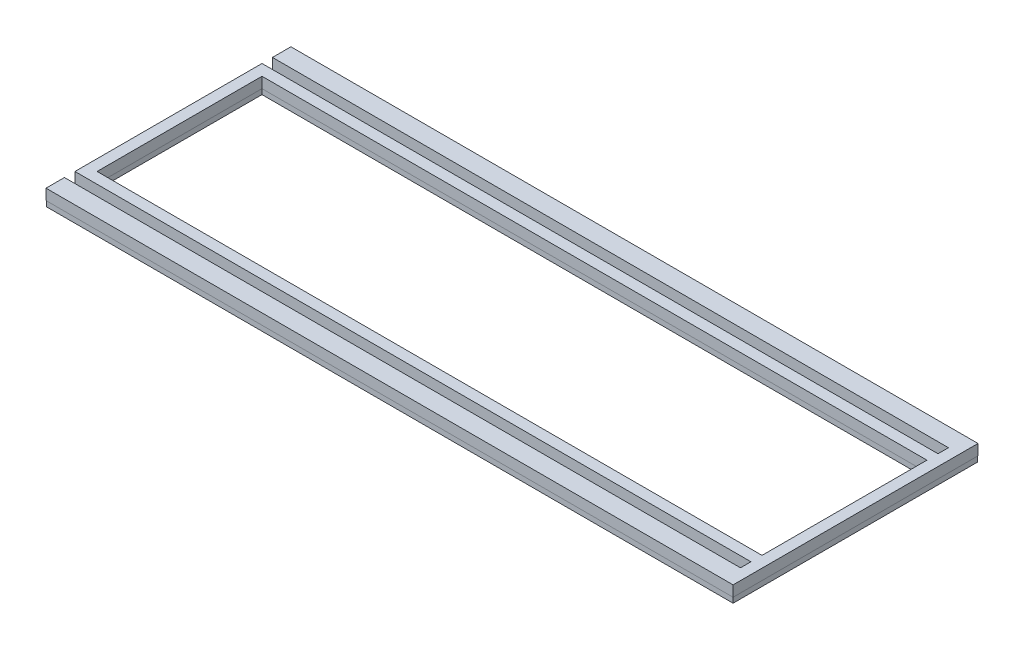
ISO-10303-21;
HEADER;
FILE_DESCRIPTION(('STEP AP214'),'2;1');
FILE_NAME('part.step','',(''),(''),'','','');
FILE_SCHEMA(('AUTOMOTIVE_DESIGN { 1 0 10303 214 1 1 1 1 }'));
ENDSEC;
DATA;
#1=APPLICATION_CONTEXT('core data for automotive mechanical design processes');
#2=APPLICATION_PROTOCOL_DEFINITION('international standard','automotive_design',2000,#1);
#3=PRODUCT_CONTEXT('',#1,'mechanical');
#4=PRODUCT('Part','Part','',(#3));
#5=PRODUCT_RELATED_PRODUCT_CATEGORY('part','',(#4));
#6=PRODUCT_DEFINITION_FORMATION('','',#4);
#7=PRODUCT_DEFINITION_CONTEXT('part definition',#1,'design');
#8=PRODUCT_DEFINITION('design','',#6,#7);
#9=PRODUCT_DEFINITION_SHAPE('','',#8);
#10=(LENGTH_UNIT() NAMED_UNIT(*) SI_UNIT(.MILLI.,.METRE.));
#11=(NAMED_UNIT(*) PLANE_ANGLE_UNIT() SI_UNIT($,.RADIAN.));
#12=(NAMED_UNIT(*) SI_UNIT($,.STERADIAN.) SOLID_ANGLE_UNIT());
#13=UNCERTAINTY_MEASURE_WITH_UNIT(LENGTH_MEASURE(1.E-05),#10,'distance_accuracy_value','');
#14=(GEOMETRIC_REPRESENTATION_CONTEXT(3) GLOBAL_UNCERTAINTY_ASSIGNED_CONTEXT((#13)) GLOBAL_UNIT_ASSIGNED_CONTEXT((#10,
#11,#12)) REPRESENTATION_CONTEXT('',''));
#15=CARTESIAN_POINT('',(0.,0.,0.));
#16=DIRECTION('',(0.,0.,1.));
#17=DIRECTION('',(1.,0.,0.));
#18=AXIS2_PLACEMENT_3D('',#15,#16,#17);
#19=CARTESIAN_POINT('',(0.,1.5875,-61.648975));
#20=DIRECTION('',(0.,0.,-1.));
#21=DIRECTION('',(-1.,0.,0.));
#22=AXIS2_PLACEMENT_3D('',#19,#20,#21);
#23=PLANE('',#22);
#24=DIRECTION('',(1.,0.,0.));
#25=VECTOR('',#24,1.);
#26=CARTESIAN_POINT('',(0.,-1.5875,-61.648975));
#27=LINE('',#26,#25);
#28=CARTESIAN_POINT('',(-203.2,-1.5875,-61.648975));
#29=VERTEX_POINT('',#28);
#30=CARTESIAN_POINT('',(196.85,-1.5875,-61.648975));
#31=VERTEX_POINT('',#30);
#32=EDGE_CURVE('E220',#29,#31,#27,.T.);
#33=ORIENTED_EDGE('',*,*,#32,.T.);
#34=DIRECTION('',(0.,-1.,0.));
#35=VECTOR('',#34,1.);
#36=CARTESIAN_POINT('',(196.85,1.5875,-61.648975));
#37=LINE('',#36,#35);
#38=CARTESIAN_POINT('',(196.85,1.5875,-61.648975));
#39=VERTEX_POINT('',#38);
#40=EDGE_CURVE('E12',#39,#31,#37,.T.);
#41=ORIENTED_EDGE('',*,*,#40,.F.);
#42=DIRECTION('',(1.,0.,0.));
#43=VECTOR('',#42,1.);
#44=CARTESIAN_POINT('',(0.,1.5875,-61.648975));
#45=LINE('',#44,#43);
#46=CARTESIAN_POINT('',(-203.2,1.5875,-61.648975));
#47=VERTEX_POINT('',#46);
#48=EDGE_CURVE('E321',#47,#39,#45,.T.);
#49=ORIENTED_EDGE('',*,*,#48,.F.);
#50=DIRECTION('',(0.,-1.,0.));
#51=VECTOR('',#50,1.);
#52=CARTESIAN_POINT('',(-203.2,1.5875,-61.648975));
#53=LINE('',#52,#51);
#54=EDGE_CURVE('E263',#47,#29,#53,.T.);
#55=ORIENTED_EDGE('',*,*,#54,.T.);
#56=EDGE_LOOP('',(#33,#41,#49,#55));
#57=FACE_BOUND('',#56,.T.);
#58=ADVANCED_FACE('F44',(#57),#23,.F.);
#59=CARTESIAN_POINT('',(196.85,1.5875,0.));
#60=DIRECTION('',(1.,0.,0.));
#61=DIRECTION('',(0.,0.,-1.));
#62=AXIS2_PLACEMENT_3D('',#59,#60,#61);
#63=PLANE('',#62);
#64=DIRECTION('',(0.,0.,1.));
#65=VECTOR('',#64,1.);
#66=CARTESIAN_POINT('',(196.85,-1.5875,0.));
#67=LINE('',#66,#65);
#68=CARTESIAN_POINT('',(196.85,-1.5875,-55.248175));
#69=VERTEX_POINT('',#68);
#70=EDGE_CURVE('E224',#31,#69,#67,.T.);
#71=ORIENTED_EDGE('',*,*,#70,.T.);
#72=DIRECTION('',(0.,-1.,0.));
#73=VECTOR('',#72,1.);
#74=CARTESIAN_POINT('',(196.85,1.5875,-55.248175));
#75=LINE('',#74,#73);
#76=CARTESIAN_POINT('',(196.85,1.5875,-55.248175));
#77=VERTEX_POINT('',#76);
#78=EDGE_CURVE('E55',#77,#69,#75,.T.);
#79=ORIENTED_EDGE('',*,*,#78,.F.);
#80=DIRECTION('',(0.,0.,1.));
#81=VECTOR('',#80,1.);
#82=CARTESIAN_POINT('',(196.85,1.5875,0.));
#83=LINE('',#82,#81);
#84=EDGE_CURVE('E335',#39,#77,#83,.T.);
#85=ORIENTED_EDGE('',*,*,#84,.F.);
#86=ORIENTED_EDGE('',*,*,#40,.T.);
#87=EDGE_LOOP('',(#71,#79,#85,#86));
#88=FACE_BOUND('',#87,.T.);
#89=ADVANCED_FACE('F378',(#88),#63,.F.);
#90=CARTESIAN_POINT('',(0.,1.5875,-55.248175));
#91=DIRECTION('',(0.,0.,-1.));
#92=DIRECTION('',(-1.,0.,0.));
#93=AXIS2_PLACEMENT_3D('',#90,#91,#92);
#94=PLANE('',#93);
#95=DIRECTION('',(1.,0.,0.));
#96=VECTOR('',#95,1.);
#97=CARTESIAN_POINT('',(0.,-1.5875,-55.248175));
#98=LINE('',#97,#96);
#99=CARTESIAN_POINT('',(-203.2,-1.5875,-55.248175));
#100=VERTEX_POINT('',#99);
#101=EDGE_CURVE('E228',#100,#69,#98,.T.);
#102=ORIENTED_EDGE('',*,*,#101,.F.);
#103=DIRECTION('',(0.,-1.,0.));
#104=VECTOR('',#103,1.);
#105=CARTESIAN_POINT('',(-203.2,1.5875,-55.248175));
#106=LINE('',#105,#104);
#107=CARTESIAN_POINT('',(-203.2,1.5875,-55.248175));
#108=VERTEX_POINT('',#107);
#109=EDGE_CURVE('E285',#108,#100,#106,.T.);
#110=ORIENTED_EDGE('',*,*,#109,.F.);
#111=DIRECTION('',(1.,0.,0.));
#112=VECTOR('',#111,1.);
#113=CARTESIAN_POINT('',(0.,1.5875,-55.248175));
#114=LINE('',#113,#112);
#115=EDGE_CURVE('E339',#108,#77,#114,.T.);
#116=ORIENTED_EDGE('',*,*,#115,.T.);
#117=ORIENTED_EDGE('',*,*,#78,.T.);
#118=EDGE_LOOP('',(#102,#110,#116,#117));
#119=FACE_BOUND('',#118,.T.);
#120=ADVANCED_FACE('F384',(#119),#94,.T.);
#121=CARTESIAN_POINT('',(-203.2,1.5875,0.));
#122=DIRECTION('',(1.,0.,0.));
#123=DIRECTION('',(0.,0.,-1.));
#124=AXIS2_PLACEMENT_3D('',#121,#122,#123);
#125=PLANE('',#124);
#126=DIRECTION('',(0.,0.,1.));
#127=VECTOR('',#126,1.);
#128=CARTESIAN_POINT('',(-203.2,-1.5875,0.));
#129=LINE('',#128,#127);
#130=CARTESIAN_POINT('',(-203.2,-1.5875,55.248175));
#131=VERTEX_POINT('',#130);
#132=EDGE_CURVE('E232',#100,#131,#129,.T.);
#133=ORIENTED_EDGE('',*,*,#132,.T.);
#134=DIRECTION('',(0.,-1.,0.));
#135=VECTOR('',#134,1.);
#136=CARTESIAN_POINT('',(-203.2,1.5875,55.248175));
#137=LINE('',#136,#135);
#138=CARTESIAN_POINT('',(-203.2,1.5875,55.248175));
#139=VERTEX_POINT('',#138);
#140=EDGE_CURVE('E281',#139,#131,#137,.T.);
#141=ORIENTED_EDGE('',*,*,#140,.F.);
#142=DIRECTION('',(0.,0.,1.));
#143=VECTOR('',#142,1.);
#144=CARTESIAN_POINT('',(-203.2,1.5875,0.));
#145=LINE('',#144,#143);
#146=EDGE_CURVE('E343',#108,#139,#145,.T.);
#147=ORIENTED_EDGE('',*,*,#146,.F.);
#148=ORIENTED_EDGE('',*,*,#109,.T.);
#149=EDGE_LOOP('',(#133,#141,#147,#148));
#150=FACE_BOUND('',#149,.T.);
#151=ADVANCED_FACE('F1012',(#150),#125,.F.);
#152=CARTESIAN_POINT('',(0.,1.5875,55.248175));
#153=DIRECTION('',(0.,0.,-1.));
#154=DIRECTION('',(-1.,0.,0.));
#155=AXIS2_PLACEMENT_3D('',#152,#153,#154);
#156=PLANE('',#155);
#157=DIRECTION('',(1.,0.,0.));
#158=VECTOR('',#157,1.);
#159=CARTESIAN_POINT('',(0.,-1.5875,55.248175));
#160=LINE('',#159,#158);
#161=CARTESIAN_POINT('',(196.85,-1.5875,55.248175));
#162=VERTEX_POINT('',#161);
#163=EDGE_CURVE('E235',#131,#162,#160,.T.);
#164=ORIENTED_EDGE('',*,*,#163,.T.);
#165=DIRECTION('',(0.,-1.,0.));
#166=VECTOR('',#165,1.);
#167=CARTESIAN_POINT('',(196.85,1.5875,55.248175));
#168=LINE('',#167,#166);
#169=CARTESIAN_POINT('',(196.85,1.5875,55.248175));
#170=VERTEX_POINT('',#169);
#171=EDGE_CURVE('E278',#170,#162,#168,.T.);
#172=ORIENTED_EDGE('',*,*,#171,.F.);
#173=DIRECTION('',(1.,0.,0.));
#174=VECTOR('',#173,1.);
#175=CARTESIAN_POINT('',(0.,1.5875,55.248175));
#176=LINE('',#175,#174);
#177=EDGE_CURVE('E347',#139,#170,#176,.T.);
#178=ORIENTED_EDGE('',*,*,#177,.F.);
#179=ORIENTED_EDGE('',*,*,#140,.T.);
#180=EDGE_LOOP('',(#164,#172,#178,#179));
#181=FACE_BOUND('',#180,.T.);
#182=ADVANCED_FACE('F1003',(#181),#156,.F.);
#183=CARTESIAN_POINT('',(196.85,1.5875,8.53594091353668E-13));
#184=DIRECTION('',(-1.,0.,0.));
#185=DIRECTION('',(0.,0.,1.));
#186=AXIS2_PLACEMENT_3D('',#183,#184,#185);
#187=PLANE('',#186);
#188=DIRECTION('',(0.,0.,-1.));
#189=VECTOR('',#188,1.);
#190=CARTESIAN_POINT('',(196.85,-1.5875,8.53594091353668E-13));
#191=LINE('',#190,#189);
#192=CARTESIAN_POINT('',(196.85,-1.5875,61.648975));
#193=VERTEX_POINT('',#192);
#194=EDGE_CURVE('E239',#193,#162,#191,.T.);
#195=ORIENTED_EDGE('',*,*,#194,.F.);
#196=DIRECTION('',(0.,-1.,0.));
#197=VECTOR('',#196,1.);
#198=CARTESIAN_POINT('',(196.85,1.5875,61.648975));
#199=LINE('',#198,#197);
#200=CARTESIAN_POINT('',(196.85,1.5875,61.648975));
#201=VERTEX_POINT('',#200);
#202=EDGE_CURVE('E275',#201,#193,#199,.T.);
#203=ORIENTED_EDGE('',*,*,#202,.F.);
#204=DIRECTION('',(0.,0.,-1.));
#205=VECTOR('',#204,1.);
#206=CARTESIAN_POINT('',(196.85,1.5875,8.53594091353668E-13));
#207=LINE('',#206,#205);
#208=EDGE_CURVE('E351',#201,#170,#207,.T.);
#209=ORIENTED_EDGE('',*,*,#208,.T.);
#210=ORIENTED_EDGE('',*,*,#171,.T.);
#211=EDGE_LOOP('',(#195,#203,#209,#210));
#212=FACE_BOUND('',#211,.T.);
#213=ADVANCED_FACE('F363',(#212),#187,.T.);
#214=CARTESIAN_POINT('',(0.,1.5875,61.648975));
#215=DIRECTION('',(0.,0.,-1.));
#216=DIRECTION('',(-1.,0.,0.));
#217=AXIS2_PLACEMENT_3D('',#214,#215,#216);
#218=PLANE('',#217);
#219=DIRECTION('',(1.,0.,0.));
#220=VECTOR('',#219,1.);
#221=CARTESIAN_POINT('',(0.,-1.5875,61.648975));
#222=LINE('',#221,#220);
#223=CARTESIAN_POINT('',(-203.2,-1.5875,61.648975));
#224=VERTEX_POINT('',#223);
#225=EDGE_CURVE('E243',#224,#193,#222,.T.);
#226=ORIENTED_EDGE('',*,*,#225,.F.);
#227=DIRECTION('',(0.,-1.,0.));
#228=VECTOR('',#227,1.);
#229=CARTESIAN_POINT('',(-203.2,1.5875,61.648975));
#230=LINE('',#229,#228);
#231=CARTESIAN_POINT('',(-203.2,1.5875,61.648975));
#232=VERTEX_POINT('',#231);
#233=EDGE_CURVE('E272',#232,#224,#230,.T.);
#234=ORIENTED_EDGE('',*,*,#233,.F.);
#235=DIRECTION('',(1.,0.,0.));
#236=VECTOR('',#235,1.);
#237=CARTESIAN_POINT('',(0.,1.5875,61.648975));
#238=LINE('',#237,#236);
#239=EDGE_CURVE('E194',#232,#201,#238,.T.);
#240=ORIENTED_EDGE('',*,*,#239,.T.);
#241=ORIENTED_EDGE('',*,*,#202,.T.);
#242=EDGE_LOOP('',(#226,#234,#240,#241));
#243=FACE_BOUND('',#242,.T.);
#244=ADVANCED_FACE('F359',(#243),#218,.T.);
#245=CARTESIAN_POINT('',(-203.2,1.5875,0.));
#246=DIRECTION('',(-1.,0.,0.));
#247=DIRECTION('',(0.,0.,1.));
#248=AXIS2_PLACEMENT_3D('',#245,#246,#247);
#249=PLANE('',#248);
#250=DIRECTION('',(0.,0.,-1.));
#251=VECTOR('',#250,1.);
#252=CARTESIAN_POINT('',(-203.2,-1.5875,0.));
#253=LINE('',#252,#251);
#254=CARTESIAN_POINT('',(-203.2,-1.5875,72.3646));
#255=VERTEX_POINT('',#254);
#256=EDGE_CURVE('E247',#255,#224,#253,.T.);
#257=ORIENTED_EDGE('',*,*,#256,.F.);
#258=DIRECTION('',(0.,-1.,0.));
#259=VECTOR('',#258,1.);
#260=CARTESIAN_POINT('',(-203.2,1.5875,72.3646));
#261=LINE('',#260,#259);
#262=CARTESIAN_POINT('',(-203.2,1.5875,72.3646));
#263=VERTEX_POINT('',#262);
#264=EDGE_CURVE('E175',#263,#255,#261,.T.);
#265=ORIENTED_EDGE('',*,*,#264,.F.);
#266=DIRECTION('',(0.,0.,-1.));
#267=VECTOR('',#266,1.);
#268=CARTESIAN_POINT('',(-203.2,1.5875,0.));
#269=LINE('',#268,#267);
#270=EDGE_CURVE('E190',#263,#232,#269,.T.);
#271=ORIENTED_EDGE('',*,*,#270,.T.);
#272=ORIENTED_EDGE('',*,*,#233,.T.);
#273=EDGE_LOOP('',(#257,#265,#271,#272));
#274=FACE_BOUND('',#273,.T.);
#275=ADVANCED_FACE('F368',(#274),#249,.T.);
#276=CARTESIAN_POINT('',(0.,1.5875,72.3646));
#277=DIRECTION('',(0.,0.,-1.));
#278=DIRECTION('',(-1.,0.,0.));
#279=AXIS2_PLACEMENT_3D('',#276,#277,#278);
#280=PLANE('',#279);
#281=DIRECTION('',(1.,0.,0.));
#282=VECTOR('',#281,1.);
#283=CARTESIAN_POINT('',(0.,-1.5875,72.3646));
#284=LINE('',#283,#282);
#285=CARTESIAN_POINT('',(203.2,-1.5875,72.3646));
#286=VERTEX_POINT('',#285);
#287=EDGE_CURVE('E170',#255,#286,#284,.T.);
#288=ORIENTED_EDGE('',*,*,#287,.T.);
#289=DIRECTION('',(0.,-1.,0.));
#290=VECTOR('',#289,1.);
#291=CARTESIAN_POINT('',(203.2,1.5875,72.3646));
#292=LINE('',#291,#290);
#293=CARTESIAN_POINT('',(203.2,1.5875,72.3646));
#294=VERTEX_POINT('',#293);
#295=EDGE_CURVE('E163',#294,#286,#292,.T.);
#296=ORIENTED_EDGE('',*,*,#295,.F.);
#297=DIRECTION('',(1.,0.,0.));
#298=VECTOR('',#297,1.);
#299=CARTESIAN_POINT('',(0.,1.5875,72.3646));
#300=LINE('',#299,#298);
#301=EDGE_CURVE('E167',#263,#294,#300,.T.);
#302=ORIENTED_EDGE('',*,*,#301,.F.);
#303=ORIENTED_EDGE('',*,*,#264,.T.);
#304=EDGE_LOOP('',(#288,#296,#302,#303));
#305=FACE_BOUND('',#304,.T.);
#306=ADVANCED_FACE('F165',(#305),#280,.F.);
#307=CARTESIAN_POINT('',(203.2,1.5875,0.));
#308=DIRECTION('',(1.,0.,0.));
#309=DIRECTION('',(0.,0.,-1.));
#310=AXIS2_PLACEMENT_3D('',#307,#308,#309);
#311=PLANE('',#310);
#312=DIRECTION('',(0.,0.,1.));
#313=VECTOR('',#312,1.);
#314=CARTESIAN_POINT('',(203.2,-1.5875,0.));
#315=LINE('',#314,#313);
#316=CARTESIAN_POINT('',(203.2,-1.5875,-72.3646));
#317=VERTEX_POINT('',#316);
#318=EDGE_CURVE('E253',#317,#286,#315,.T.);
#319=ORIENTED_EDGE('',*,*,#318,.F.);
#320=DIRECTION('',(0.,-1.,0.));
#321=VECTOR('',#320,1.);
#322=CARTESIAN_POINT('',(203.2,1.5875,-72.3646));
#323=LINE('',#322,#321);
#324=CARTESIAN_POINT('',(203.2,1.5875,-72.3646));
#325=VERTEX_POINT('',#324);
#326=EDGE_CURVE('E176',#325,#317,#323,.T.);
#327=ORIENTED_EDGE('',*,*,#326,.F.);
#328=DIRECTION('',(0.,0.,1.));
#329=VECTOR('',#328,1.);
#330=CARTESIAN_POINT('',(203.2,1.5875,0.));
#331=LINE('',#330,#329);
#332=EDGE_CURVE('E179',#325,#294,#331,.T.);
#333=ORIENTED_EDGE('',*,*,#332,.T.);
#334=ORIENTED_EDGE('',*,*,#295,.T.);
#335=EDGE_LOOP('',(#319,#327,#333,#334));
#336=FACE_BOUND('',#335,.T.);
#337=ADVANCED_FACE('F180',(#336),#311,.T.);
#338=CARTESIAN_POINT('',(0.,1.5875,-72.3646));
#339=DIRECTION('',(0.,0.,-1.));
#340=DIRECTION('',(-1.,0.,0.));
#341=AXIS2_PLACEMENT_3D('',#338,#339,#340);
#342=PLANE('',#341);
#343=DIRECTION('',(1.,0.,0.));
#344=VECTOR('',#343,1.);
#345=CARTESIAN_POINT('',(0.,-1.5875,-72.3646));
#346=LINE('',#345,#344);
#347=CARTESIAN_POINT('',(-203.2,-1.5875,-72.3646));
#348=VERTEX_POINT('',#347);
#349=EDGE_CURVE('E256',#348,#317,#346,.T.);
#350=ORIENTED_EDGE('',*,*,#349,.F.);
#351=DIRECTION('',(0.,-1.,0.));
#352=VECTOR('',#351,1.);
#353=CARTESIAN_POINT('',(-203.2,1.5875,-72.3646));
#354=LINE('',#353,#352);
#355=CARTESIAN_POINT('',(-203.2,1.5875,-72.3646));
#356=VERTEX_POINT('',#355);
#357=EDGE_CURVE('E64',#356,#348,#354,.T.);
#358=ORIENTED_EDGE('',*,*,#357,.F.);
#359=DIRECTION('',(1.,0.,0.));
#360=VECTOR('',#359,1.);
#361=CARTESIAN_POINT('',(0.,1.5875,-72.3646));
#362=LINE('',#361,#360);
#363=EDGE_CURVE('E184',#356,#325,#362,.T.);
#364=ORIENTED_EDGE('',*,*,#363,.T.);
#365=ORIENTED_EDGE('',*,*,#326,.T.);
#366=EDGE_LOOP('',(#350,#358,#364,#365));
#367=FACE_BOUND('',#366,.T.);
#368=ADVANCED_FACE('F397',(#367),#342,.T.);
#369=CARTESIAN_POINT('',(196.85,1.5875,0.));
#370=DIRECTION('',(-1.,0.,0.));
#371=DIRECTION('',(0.,0.,1.));
#372=AXIS2_PLACEMENT_3D('',#369,#370,#371);
#373=PLANE('',#372);
#374=DIRECTION('',(0.,0.,-1.));
#375=VECTOR('',#374,1.);
#376=CARTESIAN_POINT('',(196.85,-1.5875,0.));
#377=LINE('',#376,#375);
#378=CARTESIAN_POINT('',(196.85,-1.5875,48.898175));
#379=VERTEX_POINT('',#378);
#380=CARTESIAN_POINT('',(196.85,-1.5875,-48.898175));
#381=VERTEX_POINT('',#380);
#382=EDGE_CURVE('E204',#379,#381,#377,.T.);
#383=ORIENTED_EDGE('',*,*,#382,.F.);
#384=DIRECTION('',(0.,-1.,0.));
#385=VECTOR('',#384,1.);
#386=CARTESIAN_POINT('',(196.85,1.5875,48.898175));
#387=LINE('',#386,#385);
#388=CARTESIAN_POINT('',(196.85,1.5875,48.898175));
#389=VERTEX_POINT('',#388);
#390=EDGE_CURVE('E48',#389,#379,#387,.T.);
#391=ORIENTED_EDGE('',*,*,#390,.F.);
#392=DIRECTION('',(0.,0.,-1.));
#393=VECTOR('',#392,1.);
#394=CARTESIAN_POINT('',(196.85,1.5875,0.));
#395=LINE('',#394,#393);
#396=CARTESIAN_POINT('',(196.85,1.5875,-48.898175));
#397=VERTEX_POINT('',#396);
#398=EDGE_CURVE('E262',#389,#397,#395,.T.);
#399=ORIENTED_EDGE('',*,*,#398,.T.);
#400=DIRECTION('',(0.,-1.,0.));
#401=VECTOR('',#400,1.);
#402=CARTESIAN_POINT('',(196.85,1.5875,-48.898175));
#403=LINE('',#402,#401);
#404=EDGE_CURVE('E203',#397,#381,#403,.T.);
#405=ORIENTED_EDGE('',*,*,#404,.T.);
#406=EDGE_LOOP('',(#383,#391,#399,#405));
#407=FACE_BOUND('',#406,.T.);
#408=ADVANCED_FACE('F46',(#407),#373,.T.);
#409=CARTESIAN_POINT('',(0.,1.5875,48.898175));
#410=DIRECTION('',(0.,0.,-1.));
#411=DIRECTION('',(-1.,0.,0.));
#412=AXIS2_PLACEMENT_3D('',#409,#410,#411);
#413=PLANE('',#412);
#414=DIRECTION('',(1.,0.,0.));
#415=VECTOR('',#414,1.);
#416=CARTESIAN_POINT('',(0.,-1.5875,48.898175));
#417=LINE('',#416,#415);
#418=CARTESIAN_POINT('',(-196.85,-1.5875,48.898175));
#419=VERTEX_POINT('',#418);
#420=EDGE_CURVE('E208',#419,#379,#417,.T.);
#421=ORIENTED_EDGE('',*,*,#420,.F.);
#422=DIRECTION('',(0.,-1.,0.));
#423=VECTOR('',#422,1.);
#424=CARTESIAN_POINT('',(-196.85,1.5875,48.898175));
#425=LINE('',#424,#423);
#426=CARTESIAN_POINT('',(-196.85,1.5875,48.898175));
#427=VERTEX_POINT('',#426);
#428=EDGE_CURVE('E295',#427,#419,#425,.T.);
#429=ORIENTED_EDGE('',*,*,#428,.F.);
#430=DIRECTION('',(1.,0.,0.));
#431=VECTOR('',#430,1.);
#432=CARTESIAN_POINT('',(0.,1.5875,48.898175));
#433=LINE('',#432,#431);
#434=EDGE_CURVE('E305',#427,#389,#433,.T.);
#435=ORIENTED_EDGE('',*,*,#434,.T.);
#436=ORIENTED_EDGE('',*,*,#390,.T.);
#437=EDGE_LOOP('',(#421,#429,#435,#436));
#438=FACE_BOUND('',#437,.T.);
#439=ADVANCED_FACE('F303',(#438),#413,.T.);
#440=CARTESIAN_POINT('',(-196.85,1.5875,0.));
#441=DIRECTION('',(-1.,0.,0.));
#442=DIRECTION('',(0.,0.,1.));
#443=AXIS2_PLACEMENT_3D('',#440,#441,#442);
#444=PLANE('',#443);
#445=DIRECTION('',(0.,0.,-1.));
#446=VECTOR('',#445,1.);
#447=CARTESIAN_POINT('',(-196.85,-1.5875,0.));
#448=LINE('',#447,#446);
#449=CARTESIAN_POINT('',(-196.85,-1.5875,-48.898175));
#450=VERTEX_POINT('',#449);
#451=EDGE_CURVE('E213',#419,#450,#448,.T.);
#452=ORIENTED_EDGE('',*,*,#451,.T.);
#453=DIRECTION('',(0.,-1.,0.));
#454=VECTOR('',#453,1.);
#455=CARTESIAN_POINT('',(-196.85,1.5875,-48.898175));
#456=LINE('',#455,#454);
#457=CARTESIAN_POINT('',(-196.85,1.5875,-48.898175));
#458=VERTEX_POINT('',#457);
#459=EDGE_CURVE('E292',#458,#450,#456,.T.);
#460=ORIENTED_EDGE('',*,*,#459,.F.);
#461=DIRECTION('',(0.,0.,-1.));
#462=VECTOR('',#461,1.);
#463=CARTESIAN_POINT('',(-196.85,1.5875,0.));
#464=LINE('',#463,#462);
#465=EDGE_CURVE('E322',#427,#458,#464,.T.);
#466=ORIENTED_EDGE('',*,*,#465,.F.);
#467=ORIENTED_EDGE('',*,*,#428,.T.);
#468=EDGE_LOOP('',(#452,#460,#466,#467));
#469=FACE_BOUND('',#468,.T.);
#470=ADVANCED_FACE('F312',(#469),#444,.F.);
#471=CARTESIAN_POINT('',(0.,1.5875,-48.898175));
#472=DIRECTION('',(0.,0.,-1.));
#473=DIRECTION('',(-1.,0.,0.));
#474=AXIS2_PLACEMENT_3D('',#471,#472,#473);
#475=PLANE('',#474);
#476=DIRECTION('',(1.,0.,0.));
#477=VECTOR('',#476,1.);
#478=CARTESIAN_POINT('',(0.,-1.5875,-48.898175));
#479=LINE('',#478,#477);
#480=EDGE_CURVE('E216',#450,#381,#479,.T.);
#481=ORIENTED_EDGE('',*,*,#480,.T.);
#482=ORIENTED_EDGE('',*,*,#404,.F.);
#483=DIRECTION('',(1.,0.,0.));
#484=VECTOR('',#483,1.);
#485=CARTESIAN_POINT('',(0.,1.5875,-48.898175));
#486=LINE('',#485,#484);
#487=EDGE_CURVE('E317',#458,#397,#486,.T.);
#488=ORIENTED_EDGE('',*,*,#487,.F.);
#489=ORIENTED_EDGE('',*,*,#459,.T.);
#490=EDGE_LOOP('',(#481,#482,#488,#489));
#491=FACE_BOUND('',#490,.T.);
#492=ADVANCED_FACE('F315',(#491),#475,.F.);
#493=CARTESIAN_POINT('',(-203.2,1.5875,0.));
#494=DIRECTION('',(1.,0.,0.));
#495=DIRECTION('',(0.,0.,-1.));
#496=AXIS2_PLACEMENT_3D('',#493,#494,#495);
#497=PLANE('',#496);
#498=DIRECTION('',(0.,0.,1.));
#499=VECTOR('',#498,1.);
#500=CARTESIAN_POINT('',(-203.2,-1.5875,0.));
#501=LINE('',#500,#499);
#502=EDGE_CURVE('E119',#348,#29,#501,.T.);
#503=ORIENTED_EDGE('',*,*,#502,.T.);
#504=ORIENTED_EDGE('',*,*,#54,.F.);
#505=DIRECTION('',(0.,0.,1.));
#506=VECTOR('',#505,1.);
#507=CARTESIAN_POINT('',(-203.2,1.5875,0.));
#508=LINE('',#507,#506);
#509=EDGE_CURVE('E200',#356,#47,#508,.T.);
#510=ORIENTED_EDGE('',*,*,#509,.F.);
#511=ORIENTED_EDGE('',*,*,#357,.T.);
#512=EDGE_LOOP('',(#503,#504,#510,#511));
#513=FACE_BOUND('',#512,.T.);
#514=ADVANCED_FACE('F391',(#513),#497,.F.);
#515=CARTESIAN_POINT('',(0.,-1.5875,0.));
#516=DIRECTION('',(0.,1.,0.));
#517=DIRECTION('',(0.,0.,1.));
#518=AXIS2_PLACEMENT_3D('',#515,#516,#517);
#519=PLANE('',#518);
#520=ORIENTED_EDGE('',*,*,#382,.T.);
#521=ORIENTED_EDGE('',*,*,#480,.F.);
#522=ORIENTED_EDGE('',*,*,#451,.F.);
#523=ORIENTED_EDGE('',*,*,#420,.T.);
#524=EDGE_LOOP('',(#520,#521,#522,#523));
#525=FACE_BOUND('',#524,.T.);
#526=ORIENTED_EDGE('',*,*,#32,.F.);
#527=ORIENTED_EDGE('',*,*,#502,.F.);
#528=ORIENTED_EDGE('',*,*,#349,.T.);
#529=ORIENTED_EDGE('',*,*,#318,.T.);
#530=ORIENTED_EDGE('',*,*,#287,.F.);
#531=ORIENTED_EDGE('',*,*,#256,.T.);
#532=ORIENTED_EDGE('',*,*,#225,.T.);
#533=ORIENTED_EDGE('',*,*,#194,.T.);
#534=ORIENTED_EDGE('',*,*,#163,.F.);
#535=ORIENTED_EDGE('',*,*,#132,.F.);
#536=ORIENTED_EDGE('',*,*,#101,.T.);
#537=ORIENTED_EDGE('',*,*,#70,.F.);
#538=EDGE_LOOP('',(#526,#527,#528,#529,#530,#531,#532,#533,#534,#535,#536,#537));
#539=FACE_BOUND('',#538,.T.);
#540=ADVANCED_FACE('F310',(#525,#539),#519,.F.);
#541=CARTESIAN_POINT('',(0.,1.5875,0.));
#542=DIRECTION('',(0.,1.,0.));
#543=DIRECTION('',(0.,0.,1.));
#544=AXIS2_PLACEMENT_3D('',#541,#542,#543);
#545=PLANE('',#544);
#546=DIRECTION('',(0.,0.,1.));
#547=VECTOR('',#546,1.);
#548=CARTESIAN_POINT('',(-203.3016,1.5875,-72.4662));
#549=LINE('',#548,#547);
#550=CARTESIAN_POINT('',(-203.3016,1.5875,-72.4662));
#551=VERTEX_POINT('',#550);
#552=CARTESIAN_POINT('',(-203.3016,1.5875,-61.547375));
#553=VERTEX_POINT('',#552);
#554=EDGE_CURVE('E530',#551,#553,#549,.T.);
#555=ORIENTED_EDGE('',*,*,#554,.F.);
#556=DIRECTION('',(-1.,0.,0.));
#557=VECTOR('',#556,1.);
#558=CARTESIAN_POINT('',(203.3016,1.5875,-72.4662));
#559=LINE('',#558,#557);
#560=CARTESIAN_POINT('',(203.3016,1.5875,-72.4662));
#561=VERTEX_POINT('',#560);
#562=EDGE_CURVE('E537',#561,#551,#559,.T.);
#563=ORIENTED_EDGE('',*,*,#562,.F.);
#564=DIRECTION('',(0.,0.,-1.));
#565=VECTOR('',#564,1.);
#566=CARTESIAN_POINT('',(203.3016,1.5875,72.4662));
#567=LINE('',#566,#565);
#568=CARTESIAN_POINT('',(203.3016,1.5875,72.4662));
#569=VERTEX_POINT('',#568);
#570=EDGE_CURVE('E639',#569,#561,#567,.T.);
#571=ORIENTED_EDGE('',*,*,#570,.F.);
#572=DIRECTION('',(1.,0.,0.));
#573=VECTOR('',#572,1.);
#574=CARTESIAN_POINT('',(-203.3016,1.5875,72.4662));
#575=LINE('',#574,#573);
#576=CARTESIAN_POINT('',(-203.3016,1.5875,72.4662));
#577=VERTEX_POINT('',#576);
#578=EDGE_CURVE('E635',#577,#569,#575,.T.);
#579=ORIENTED_EDGE('',*,*,#578,.F.);
#580=DIRECTION('',(0.,0.,1.));
#581=VECTOR('',#580,1.);
#582=CARTESIAN_POINT('',(-203.3016,1.5875,61.547375));
#583=LINE('',#582,#581);
#584=CARTESIAN_POINT('',(-203.3016,1.5875,61.547375));
#585=VERTEX_POINT('',#584);
#586=EDGE_CURVE('E631',#585,#577,#583,.T.);
#587=ORIENTED_EDGE('',*,*,#586,.F.);
#588=DIRECTION('',(-1.,0.,0.));
#589=VECTOR('',#588,1.);
#590=CARTESIAN_POINT('',(196.7484,1.5875,61.547375));
#591=LINE('',#590,#589);
#592=CARTESIAN_POINT('',(196.7484,1.5875,61.547375));
#593=VERTEX_POINT('',#592);
#594=EDGE_CURVE('E627',#593,#585,#591,.T.);
#595=ORIENTED_EDGE('',*,*,#594,.F.);
#596=DIRECTION('',(0.,0.,1.));
#597=VECTOR('',#596,1.);
#598=CARTESIAN_POINT('',(196.7484,1.5875,55.349775));
#599=LINE('',#598,#597);
#600=CARTESIAN_POINT('',(196.7484,1.5875,55.349775));
#601=VERTEX_POINT('',#600);
#602=EDGE_CURVE('E623',#601,#593,#599,.T.);
#603=ORIENTED_EDGE('',*,*,#602,.F.);
#604=DIRECTION('',(1.,0.,0.));
#605=VECTOR('',#604,1.);
#606=CARTESIAN_POINT('',(-203.3016,1.5875,55.349775));
#607=LINE('',#606,#605);
#608=CARTESIAN_POINT('',(-203.3016,1.5875,55.349775));
#609=VERTEX_POINT('',#608);
#610=EDGE_CURVE('E619',#609,#601,#607,.T.);
#611=ORIENTED_EDGE('',*,*,#610,.F.);
#612=DIRECTION('',(0.,0.,1.));
#613=VECTOR('',#612,1.);
#614=CARTESIAN_POINT('',(-203.3016,1.5875,-55.349775));
#615=LINE('',#614,#613);
#616=CARTESIAN_POINT('',(-203.3016,1.5875,-55.349775));
#617=VERTEX_POINT('',#616);
#618=EDGE_CURVE('E615',#617,#609,#615,.T.);
#619=ORIENTED_EDGE('',*,*,#618,.F.);
#620=DIRECTION('',(-1.,0.,0.));
#621=VECTOR('',#620,1.);
#622=CARTESIAN_POINT('',(196.7484,1.5875,-55.349775));
#623=LINE('',#622,#621);
#624=CARTESIAN_POINT('',(196.7484,1.5875,-55.349775));
#625=VERTEX_POINT('',#624);
#626=EDGE_CURVE('E611',#625,#617,#623,.T.);
#627=ORIENTED_EDGE('',*,*,#626,.F.);
#628=DIRECTION('',(0.,0.,1.));
#629=VECTOR('',#628,1.);
#630=CARTESIAN_POINT('',(196.7484,1.5875,-61.547375));
#631=LINE('',#630,#629);
#632=CARTESIAN_POINT('',(196.7484,1.5875,-61.547375));
#633=VERTEX_POINT('',#632);
#634=EDGE_CURVE('E607',#633,#625,#631,.T.);
#635=ORIENTED_EDGE('',*,*,#634,.F.);
#636=DIRECTION('',(1.,0.,0.));
#637=VECTOR('',#636,1.);
#638=CARTESIAN_POINT('',(-203.3016,1.5875,-61.547375));
#639=LINE('',#638,#637);
#640=EDGE_CURVE('E603',#553,#633,#639,.T.);
#641=ORIENTED_EDGE('',*,*,#640,.F.);
#642=EDGE_LOOP('',(#555,#563,#571,#579,#587,#595,#603,#611,#619,#627,#635,#641));
#643=FACE_BOUND('',#642,.T.);
#644=ORIENTED_EDGE('',*,*,#509,.T.);
#645=ORIENTED_EDGE('',*,*,#48,.T.);
#646=ORIENTED_EDGE('',*,*,#84,.T.);
#647=ORIENTED_EDGE('',*,*,#115,.F.);
#648=ORIENTED_EDGE('',*,*,#146,.T.);
#649=ORIENTED_EDGE('',*,*,#177,.T.);
#650=ORIENTED_EDGE('',*,*,#208,.F.);
#651=ORIENTED_EDGE('',*,*,#239,.F.);
#652=ORIENTED_EDGE('',*,*,#270,.F.);
#653=ORIENTED_EDGE('',*,*,#301,.T.);
#654=ORIENTED_EDGE('',*,*,#332,.F.);
#655=ORIENTED_EDGE('',*,*,#363,.F.);
#656=EDGE_LOOP('',(#644,#645,#646,#647,#648,#649,#650,#651,#652,#653,#654,#655));
#657=FACE_BOUND('',#656,.T.);
#658=ADVANCED_FACE('F187',(#643,#657),#545,.F.);
#659=CARTESIAN_POINT('',(0.,7.9375,0.));
#660=DIRECTION('',(0.,1.,0.));
#661=DIRECTION('',(0.,0.,1.));
#662=AXIS2_PLACEMENT_3D('',#659,#660,#661);
#663=PLANE('',#662);
#664=DIRECTION('',(0.,0.,1.));
#665=VECTOR('',#664,1.);
#666=CARTESIAN_POINT('',(-203.3016,7.9375,-72.4662));
#667=LINE('',#666,#665);
#668=CARTESIAN_POINT('',(-203.3016,7.9375,-72.4662));
#669=VERTEX_POINT('',#668);
#670=CARTESIAN_POINT('',(-203.3016,7.9375,-61.547375));
#671=VERTEX_POINT('',#670);
#672=EDGE_CURVE('E531',#669,#671,#667,.T.);
#673=ORIENTED_EDGE('',*,*,#672,.T.);
#674=DIRECTION('',(1.,0.,0.));
#675=VECTOR('',#674,1.);
#676=CARTESIAN_POINT('',(-203.3016,7.9375,-61.547375));
#677=LINE('',#676,#675);
#678=CARTESIAN_POINT('',(196.7484,7.9375,-61.547375));
#679=VERTEX_POINT('',#678);
#680=EDGE_CURVE('E536',#671,#679,#677,.T.);
#681=ORIENTED_EDGE('',*,*,#680,.T.);
#682=DIRECTION('',(0.,0.,1.));
#683=VECTOR('',#682,1.);
#684=CARTESIAN_POINT('',(196.7484,7.9375,-61.547375));
#685=LINE('',#684,#683);
#686=CARTESIAN_POINT('',(196.7484,7.9375,-55.349775));
#687=VERTEX_POINT('',#686);
#688=EDGE_CURVE('E546',#679,#687,#685,.T.);
#689=ORIENTED_EDGE('',*,*,#688,.T.);
#690=DIRECTION('',(-1.,0.,0.));
#691=VECTOR('',#690,1.);
#692=CARTESIAN_POINT('',(196.7484,7.9375,-55.349775));
#693=LINE('',#692,#691);
#694=CARTESIAN_POINT('',(-203.3016,7.9375,-55.349775));
#695=VERTEX_POINT('',#694);
#696=EDGE_CURVE('E550',#687,#695,#693,.T.);
#697=ORIENTED_EDGE('',*,*,#696,.T.);
#698=DIRECTION('',(0.,0.,1.));
#699=VECTOR('',#698,1.);
#700=CARTESIAN_POINT('',(-203.3016,7.9375,-55.349775));
#701=LINE('',#700,#699);
#702=CARTESIAN_POINT('',(-203.3016,7.9375,55.349775));
#703=VERTEX_POINT('',#702);
#704=EDGE_CURVE('E555',#695,#703,#701,.T.);
#705=ORIENTED_EDGE('',*,*,#704,.T.);
#706=DIRECTION('',(1.,0.,0.));
#707=VECTOR('',#706,1.);
#708=CARTESIAN_POINT('',(-203.3016,7.9375,55.349775));
#709=LINE('',#708,#707);
#710=CARTESIAN_POINT('',(196.7484,7.9375,55.349775));
#711=VERTEX_POINT('',#710);
#712=EDGE_CURVE('E560',#703,#711,#709,.T.);
#713=ORIENTED_EDGE('',*,*,#712,.T.);
#714=DIRECTION('',(0.,0.,1.));
#715=VECTOR('',#714,1.);
#716=CARTESIAN_POINT('',(196.7484,7.9375,55.349775));
#717=LINE('',#716,#715);
#718=CARTESIAN_POINT('',(196.7484,7.9375,61.547375));
#719=VERTEX_POINT('',#718);
#720=EDGE_CURVE('E568',#711,#719,#717,.T.);
#721=ORIENTED_EDGE('',*,*,#720,.T.);
#722=DIRECTION('',(-1.,0.,0.));
#723=VECTOR('',#722,1.);
#724=CARTESIAN_POINT('',(196.7484,7.9375,61.547375));
#725=LINE('',#724,#723);
#726=CARTESIAN_POINT('',(-203.3016,7.9375,61.547375));
#727=VERTEX_POINT('',#726);
#728=EDGE_CURVE('E572',#719,#727,#725,.T.);
#729=ORIENTED_EDGE('',*,*,#728,.T.);
#730=DIRECTION('',(0.,0.,1.));
#731=VECTOR('',#730,1.);
#732=CARTESIAN_POINT('',(-203.3016,7.9375,61.547375));
#733=LINE('',#732,#731);
#734=CARTESIAN_POINT('',(-203.3016,7.9375,72.4662));
#735=VERTEX_POINT('',#734);
#736=EDGE_CURVE('E577',#727,#735,#733,.T.);
#737=ORIENTED_EDGE('',*,*,#736,.T.);
#738=DIRECTION('',(1.,0.,0.));
#739=VECTOR('',#738,1.);
#740=CARTESIAN_POINT('',(-203.3016,7.9375,72.4662));
#741=LINE('',#740,#739);
#742=CARTESIAN_POINT('',(203.3016,7.9375,72.4662));
#743=VERTEX_POINT('',#742);
#744=EDGE_CURVE('E582',#735,#743,#741,.T.);
#745=ORIENTED_EDGE('',*,*,#744,.T.);
#746=DIRECTION('',(0.,0.,-1.));
#747=VECTOR('',#746,1.);
#748=CARTESIAN_POINT('',(203.3016,7.9375,72.4662));
#749=LINE('',#748,#747);
#750=CARTESIAN_POINT('',(203.3016,7.9375,-72.4662));
#751=VERTEX_POINT('',#750);
#752=EDGE_CURVE('E590',#743,#751,#749,.T.);
#753=ORIENTED_EDGE('',*,*,#752,.T.);
#754=DIRECTION('',(-1.,0.,0.));
#755=VECTOR('',#754,1.);
#756=CARTESIAN_POINT('',(203.3016,7.9375,-72.4662));
#757=LINE('',#756,#755);
#758=EDGE_CURVE('E594',#751,#669,#757,.T.);
#759=ORIENTED_EDGE('',*,*,#758,.T.);
#760=EDGE_LOOP('',(#673,#681,#689,#697,#705,#713,#721,#729,#737,#745,#753,#759));
#761=FACE_BOUND('',#760,.T.);
#762=DIRECTION('',(0.,0.,-1.));
#763=VECTOR('',#762,1.);
#764=CARTESIAN_POINT('',(196.7484,7.9375,48.796575));
#765=LINE('',#764,#763);
#766=CARTESIAN_POINT('',(196.7484,7.9375,48.796575));
#767=VERTEX_POINT('',#766);
#768=CARTESIAN_POINT('',(196.7484,7.9375,-48.796575));
#769=VERTEX_POINT('',#768);
#770=EDGE_CURVE('E767',#767,#769,#765,.T.);
#771=ORIENTED_EDGE('',*,*,#770,.F.);
#772=DIRECTION('',(1.,0.,0.));
#773=VECTOR('',#772,1.);
#774=CARTESIAN_POINT('',(-196.7484,7.9375,48.796575));
#775=LINE('',#774,#773);
#776=CARTESIAN_POINT('',(-196.7484,7.9375,48.796575));
#777=VERTEX_POINT('',#776);
#778=EDGE_CURVE('E502',#777,#767,#775,.T.);
#779=ORIENTED_EDGE('',*,*,#778,.F.);
#780=DIRECTION('',(0.,0.,1.));
#781=VECTOR('',#780,1.);
#782=CARTESIAN_POINT('',(-196.7484,7.9375,-48.796575));
#783=LINE('',#782,#781);
#784=CARTESIAN_POINT('',(-196.7484,7.9375,-48.796575));
#785=VERTEX_POINT('',#784);
#786=EDGE_CURVE('E519',#785,#777,#783,.T.);
#787=ORIENTED_EDGE('',*,*,#786,.F.);
#788=DIRECTION('',(-1.,0.,0.));
#789=VECTOR('',#788,1.);
#790=CARTESIAN_POINT('',(196.7484,7.9375,-48.796575));
#791=LINE('',#790,#789);
#792=EDGE_CURVE('E770',#769,#785,#791,.T.);
#793=ORIENTED_EDGE('',*,*,#792,.F.);
#794=EDGE_LOOP('',(#771,#779,#787,#793));
#795=FACE_BOUND('',#794,.T.);
#796=ADVANCED_FACE('F462',(#761,#795),#663,.T.);
#797=ORIENTED_EDGE('',*,*,#398,.F.);
#798=ORIENTED_EDGE('',*,*,#434,.F.);
#799=ORIENTED_EDGE('',*,*,#465,.T.);
#800=ORIENTED_EDGE('',*,*,#487,.T.);
#801=EDGE_LOOP('',(#797,#798,#799,#800));
#802=FACE_BOUND('',#801,.T.);
#803=DIRECTION('',(1.,0.,0.));
#804=VECTOR('',#803,1.);
#805=CARTESIAN_POINT('',(-196.7484,1.5875,48.796575));
#806=LINE('',#805,#804);
#807=CARTESIAN_POINT('',(-196.7484,1.5875,48.796575));
#808=VERTEX_POINT('',#807);
#809=CARTESIAN_POINT('',(196.7484,1.5875,48.796575));
#810=VERTEX_POINT('',#809);
#811=EDGE_CURVE('E513',#808,#810,#806,.T.);
#812=ORIENTED_EDGE('',*,*,#811,.T.);
#813=DIRECTION('',(0.,0.,-1.));
#814=VECTOR('',#813,1.);
#815=CARTESIAN_POINT('',(196.7484,1.5875,48.796575));
#816=LINE('',#815,#814);
#817=CARTESIAN_POINT('',(196.7484,1.5875,-48.796575));
#818=VERTEX_POINT('',#817);
#819=EDGE_CURVE('E508',#810,#818,#816,.T.);
#820=ORIENTED_EDGE('',*,*,#819,.T.);
#821=DIRECTION('',(-1.,0.,0.));
#822=VECTOR('',#821,1.);
#823=CARTESIAN_POINT('',(196.7484,1.5875,-48.796575));
#824=LINE('',#823,#822);
#825=CARTESIAN_POINT('',(-196.7484,1.5875,-48.796575));
#826=VERTEX_POINT('',#825);
#827=EDGE_CURVE('E503',#818,#826,#824,.T.);
#828=ORIENTED_EDGE('',*,*,#827,.T.);
#829=DIRECTION('',(0.,0.,1.));
#830=VECTOR('',#829,1.);
#831=CARTESIAN_POINT('',(-196.7484,1.5875,-48.796575));
#832=LINE('',#831,#830);
#833=EDGE_CURVE('E487',#826,#808,#832,.T.);
#834=ORIENTED_EDGE('',*,*,#833,.T.);
#835=EDGE_LOOP('',(#812,#820,#828,#834));
#836=FACE_BOUND('',#835,.T.);
#837=ADVANCED_FACE('F324',(#802,#836),#545,.F.);
#838=CARTESIAN_POINT('',(-203.3016,7.9375,-72.4662));
#839=DIRECTION('',(1.,0.,0.));
#840=DIRECTION('',(0.,0.,-1.));
#841=AXIS2_PLACEMENT_3D('',#838,#839,#840);
#842=PLANE('',#841);
#843=ORIENTED_EDGE('',*,*,#554,.T.);
#844=DIRECTION('',(0.,-1.,0.));
#845=VECTOR('',#844,1.);
#846=CARTESIAN_POINT('',(-203.3016,7.9375,-61.547375));
#847=LINE('',#846,#845);
#848=EDGE_CURVE('E209',#671,#553,#847,.T.);
#849=ORIENTED_EDGE('',*,*,#848,.F.);
#850=ORIENTED_EDGE('',*,*,#672,.F.);
#851=DIRECTION('',(0.,-1.,0.));
#852=VECTOR('',#851,1.);
#853=CARTESIAN_POINT('',(-203.3016,7.9375,-72.4662));
#854=LINE('',#853,#852);
#855=EDGE_CURVE('E599',#669,#551,#854,.T.);
#856=ORIENTED_EDGE('',*,*,#855,.T.);
#857=EDGE_LOOP('',(#843,#849,#850,#856));
#858=FACE_BOUND('',#857,.T.);
#859=ADVANCED_FACE('F411',(#858),#842,.F.);
#860=CARTESIAN_POINT('',(-203.3016,7.9375,-61.547375));
#861=DIRECTION('',(0.,0.,-1.));
#862=DIRECTION('',(-1.,0.,0.));
#863=AXIS2_PLACEMENT_3D('',#860,#861,#862);
#864=PLANE('',#863);
#865=ORIENTED_EDGE('',*,*,#640,.T.);
#866=DIRECTION('',(0.,-1.,0.));
#867=VECTOR('',#866,1.);
#868=CARTESIAN_POINT('',(196.7484,7.9375,-61.547375));
#869=LINE('',#868,#867);
#870=EDGE_CURVE('E685',#679,#633,#869,.T.);
#871=ORIENTED_EDGE('',*,*,#870,.F.);
#872=ORIENTED_EDGE('',*,*,#680,.F.);
#873=ORIENTED_EDGE('',*,*,#848,.T.);
#874=EDGE_LOOP('',(#865,#871,#872,#873));
#875=FACE_BOUND('',#874,.T.);
#876=ADVANCED_FACE('F414',(#875),#864,.F.);
#877=CARTESIAN_POINT('',(196.7484,7.9375,-61.547375));
#878=DIRECTION('',(1.,0.,0.));
#879=DIRECTION('',(0.,0.,-1.));
#880=AXIS2_PLACEMENT_3D('',#877,#878,#879);
#881=PLANE('',#880);
#882=ORIENTED_EDGE('',*,*,#634,.T.);
#883=DIRECTION('',(0.,-1.,0.));
#884=VECTOR('',#883,1.);
#885=CARTESIAN_POINT('',(196.7484,7.9375,-55.349775));
#886=LINE('',#885,#884);
#887=EDGE_CURVE('E681',#687,#625,#886,.T.);
#888=ORIENTED_EDGE('',*,*,#887,.F.);
#889=ORIENTED_EDGE('',*,*,#688,.F.);
#890=ORIENTED_EDGE('',*,*,#870,.T.);
#891=EDGE_LOOP('',(#882,#888,#889,#890));
#892=FACE_BOUND('',#891,.T.);
#893=ADVANCED_FACE('F418',(#892),#881,.F.);
#894=CARTESIAN_POINT('',(196.7484,7.9375,-55.349775));
#895=DIRECTION('',(0.,0.,1.));
#896=DIRECTION('',(1.,0.,0.));
#897=AXIS2_PLACEMENT_3D('',#894,#895,#896);
#898=PLANE('',#897);
#899=ORIENTED_EDGE('',*,*,#626,.T.);
#900=DIRECTION('',(0.,-1.,0.));
#901=VECTOR('',#900,1.);
#902=CARTESIAN_POINT('',(-203.3016,7.9375,-55.349775));
#903=LINE('',#902,#901);
#904=EDGE_CURVE('E677',#695,#617,#903,.T.);
#905=ORIENTED_EDGE('',*,*,#904,.F.);
#906=ORIENTED_EDGE('',*,*,#696,.F.);
#907=ORIENTED_EDGE('',*,*,#887,.T.);
#908=EDGE_LOOP('',(#899,#905,#906,#907));
#909=FACE_BOUND('',#908,.T.);
#910=ADVANCED_FACE('F422',(#909),#898,.F.);
#911=CARTESIAN_POINT('',(-203.3016,7.9375,-55.349775));
#912=DIRECTION('',(1.,0.,0.));
#913=DIRECTION('',(0.,0.,-1.));
#914=AXIS2_PLACEMENT_3D('',#911,#912,#913);
#915=PLANE('',#914);
#916=ORIENTED_EDGE('',*,*,#618,.T.);
#917=DIRECTION('',(0.,-1.,0.));
#918=VECTOR('',#917,1.);
#919=CARTESIAN_POINT('',(-203.3016,7.9375,55.349775));
#920=LINE('',#919,#918);
#921=EDGE_CURVE('E673',#703,#609,#920,.T.);
#922=ORIENTED_EDGE('',*,*,#921,.F.);
#923=ORIENTED_EDGE('',*,*,#704,.F.);
#924=ORIENTED_EDGE('',*,*,#904,.T.);
#925=EDGE_LOOP('',(#916,#922,#923,#924));
#926=FACE_BOUND('',#925,.T.);
#927=ADVANCED_FACE('F426',(#926),#915,.F.);
#928=CARTESIAN_POINT('',(-203.3016,7.9375,55.349775));
#929=DIRECTION('',(0.,0.,-1.));
#930=DIRECTION('',(-1.,0.,0.));
#931=AXIS2_PLACEMENT_3D('',#928,#929,#930);
#932=PLANE('',#931);
#933=ORIENTED_EDGE('',*,*,#610,.T.);
#934=DIRECTION('',(0.,-1.,0.));
#935=VECTOR('',#934,1.);
#936=CARTESIAN_POINT('',(196.7484,7.9375,55.349775));
#937=LINE('',#936,#935);
#938=EDGE_CURVE('E669',#711,#601,#937,.T.);
#939=ORIENTED_EDGE('',*,*,#938,.F.);
#940=ORIENTED_EDGE('',*,*,#712,.F.);
#941=ORIENTED_EDGE('',*,*,#921,.T.);
#942=EDGE_LOOP('',(#933,#939,#940,#941));
#943=FACE_BOUND('',#942,.T.);
#944=ADVANCED_FACE('F430',(#943),#932,.F.);
#945=CARTESIAN_POINT('',(196.7484,7.9375,55.349775));
#946=DIRECTION('',(1.,0.,0.));
#947=DIRECTION('',(0.,0.,-1.));
#948=AXIS2_PLACEMENT_3D('',#945,#946,#947);
#949=PLANE('',#948);
#950=ORIENTED_EDGE('',*,*,#602,.T.);
#951=DIRECTION('',(0.,-1.,0.));
#952=VECTOR('',#951,1.);
#953=CARTESIAN_POINT('',(196.7484,7.9375,61.547375));
#954=LINE('',#953,#952);
#955=EDGE_CURVE('E665',#719,#593,#954,.T.);
#956=ORIENTED_EDGE('',*,*,#955,.F.);
#957=ORIENTED_EDGE('',*,*,#720,.F.);
#958=ORIENTED_EDGE('',*,*,#938,.T.);
#959=EDGE_LOOP('',(#950,#956,#957,#958));
#960=FACE_BOUND('',#959,.T.);
#961=ADVANCED_FACE('F434',(#960),#949,.F.);
#962=CARTESIAN_POINT('',(196.7484,7.9375,61.547375));
#963=DIRECTION('',(0.,0.,1.));
#964=DIRECTION('',(1.,0.,0.));
#965=AXIS2_PLACEMENT_3D('',#962,#963,#964);
#966=PLANE('',#965);
#967=ORIENTED_EDGE('',*,*,#594,.T.);
#968=DIRECTION('',(0.,-1.,0.));
#969=VECTOR('',#968,1.);
#970=CARTESIAN_POINT('',(-203.3016,7.9375,61.547375));
#971=LINE('',#970,#969);
#972=EDGE_CURVE('E661',#727,#585,#971,.T.);
#973=ORIENTED_EDGE('',*,*,#972,.F.);
#974=ORIENTED_EDGE('',*,*,#728,.F.);
#975=ORIENTED_EDGE('',*,*,#955,.T.);
#976=EDGE_LOOP('',(#967,#973,#974,#975));
#977=FACE_BOUND('',#976,.T.);
#978=ADVANCED_FACE('F438',(#977),#966,.F.);
#979=CARTESIAN_POINT('',(-203.3016,7.9375,61.547375));
#980=DIRECTION('',(1.,0.,0.));
#981=DIRECTION('',(0.,0.,-1.));
#982=AXIS2_PLACEMENT_3D('',#979,#980,#981);
#983=PLANE('',#982);
#984=ORIENTED_EDGE('',*,*,#586,.T.);
#985=DIRECTION('',(0.,-1.,0.));
#986=VECTOR('',#985,1.);
#987=CARTESIAN_POINT('',(-203.3016,7.9375,72.4662));
#988=LINE('',#987,#986);
#989=EDGE_CURVE('E657',#735,#577,#988,.T.);
#990=ORIENTED_EDGE('',*,*,#989,.F.);
#991=ORIENTED_EDGE('',*,*,#736,.F.);
#992=ORIENTED_EDGE('',*,*,#972,.T.);
#993=EDGE_LOOP('',(#984,#990,#991,#992));
#994=FACE_BOUND('',#993,.T.);
#995=ADVANCED_FACE('F442',(#994),#983,.F.);
#996=CARTESIAN_POINT('',(-203.3016,7.9375,72.4662));
#997=DIRECTION('',(0.,0.,-1.));
#998=DIRECTION('',(-1.,0.,0.));
#999=AXIS2_PLACEMENT_3D('',#996,#997,#998);
#1000=PLANE('',#999);
#1001=ORIENTED_EDGE('',*,*,#578,.T.);
#1002=DIRECTION('',(0.,-1.,0.));
#1003=VECTOR('',#1002,1.);
#1004=CARTESIAN_POINT('',(203.3016,7.9375,72.4662));
#1005=LINE('',#1004,#1003);
#1006=EDGE_CURVE('E653',#743,#569,#1005,.T.);
#1007=ORIENTED_EDGE('',*,*,#1006,.F.);
#1008=ORIENTED_EDGE('',*,*,#744,.F.);
#1009=ORIENTED_EDGE('',*,*,#989,.T.);
#1010=EDGE_LOOP('',(#1001,#1007,#1008,#1009));
#1011=FACE_BOUND('',#1010,.T.);
#1012=ADVANCED_FACE('F446',(#1011),#1000,.F.);
#1013=CARTESIAN_POINT('',(203.3016,7.9375,72.4662));
#1014=DIRECTION('',(-1.,0.,0.));
#1015=DIRECTION('',(0.,0.,1.));
#1016=AXIS2_PLACEMENT_3D('',#1013,#1014,#1015);
#1017=PLANE('',#1016);
#1018=ORIENTED_EDGE('',*,*,#570,.T.);
#1019=DIRECTION('',(0.,-1.,0.));
#1020=VECTOR('',#1019,1.);
#1021=CARTESIAN_POINT('',(203.3016,7.9375,-72.4662));
#1022=LINE('',#1021,#1020);
#1023=EDGE_CURVE('E649',#751,#561,#1022,.T.);
#1024=ORIENTED_EDGE('',*,*,#1023,.F.);
#1025=ORIENTED_EDGE('',*,*,#752,.F.);
#1026=ORIENTED_EDGE('',*,*,#1006,.T.);
#1027=EDGE_LOOP('',(#1018,#1024,#1025,#1026));
#1028=FACE_BOUND('',#1027,.T.);
#1029=ADVANCED_FACE('F450',(#1028),#1017,.F.);
#1030=CARTESIAN_POINT('',(203.3016,7.9375,-72.4662));
#1031=DIRECTION('',(0.,0.,1.));
#1032=DIRECTION('',(1.,0.,0.));
#1033=AXIS2_PLACEMENT_3D('',#1030,#1031,#1032);
#1034=PLANE('',#1033);
#1035=ORIENTED_EDGE('',*,*,#562,.T.);
#1036=ORIENTED_EDGE('',*,*,#855,.F.);
#1037=ORIENTED_EDGE('',*,*,#758,.F.);
#1038=ORIENTED_EDGE('',*,*,#1023,.T.);
#1039=EDGE_LOOP('',(#1035,#1036,#1037,#1038));
#1040=FACE_BOUND('',#1039,.T.);
#1041=ADVANCED_FACE('F454',(#1040),#1034,.F.);
#1042=CARTESIAN_POINT('',(-196.7484,7.9375,48.796575));
#1043=DIRECTION('',(0.,0.,-1.));
#1044=DIRECTION('',(-1.,0.,0.));
#1045=AXIS2_PLACEMENT_3D('',#1042,#1043,#1044);
#1046=PLANE('',#1045);
#1047=ORIENTED_EDGE('',*,*,#811,.F.);
#1048=DIRECTION('',(0.,-1.,0.));
#1049=VECTOR('',#1048,1.);
#1050=CARTESIAN_POINT('',(-196.7484,7.9375,48.796575));
#1051=LINE('',#1050,#1049);
#1052=EDGE_CURVE('E496',#777,#808,#1051,.T.);
#1053=ORIENTED_EDGE('',*,*,#1052,.F.);
#1054=ORIENTED_EDGE('',*,*,#778,.T.);
#1055=DIRECTION('',(0.,-1.,0.));
#1056=VECTOR('',#1055,1.);
#1057=CARTESIAN_POINT('',(196.7484,7.9375,48.796575));
#1058=LINE('',#1057,#1056);
#1059=EDGE_CURVE('E526',#767,#810,#1058,.T.);
#1060=ORIENTED_EDGE('',*,*,#1059,.T.);
#1061=EDGE_LOOP('',(#1047,#1053,#1054,#1060));
#1062=FACE_BOUND('',#1061,.T.);
#1063=ADVANCED_FACE('F458',(#1062),#1046,.T.);
#1064=CARTESIAN_POINT('',(196.7484,7.9375,48.796575));
#1065=DIRECTION('',(-1.,0.,0.));
#1066=DIRECTION('',(0.,0.,1.));
#1067=AXIS2_PLACEMENT_3D('',#1064,#1065,#1066);
#1068=PLANE('',#1067);
#1069=ORIENTED_EDGE('',*,*,#819,.F.);
#1070=ORIENTED_EDGE('',*,*,#1059,.F.);
#1071=ORIENTED_EDGE('',*,*,#770,.T.);
#1072=DIRECTION('',(0.,-1.,0.));
#1073=VECTOR('',#1072,1.);
#1074=CARTESIAN_POINT('',(196.7484,7.9375,-48.796575));
#1075=LINE('',#1074,#1073);
#1076=EDGE_CURVE('E522',#769,#818,#1075,.T.);
#1077=ORIENTED_EDGE('',*,*,#1076,.T.);
#1078=EDGE_LOOP('',(#1069,#1070,#1071,#1077));
#1079=FACE_BOUND('',#1078,.T.);
#1080=ADVANCED_FACE('F468',(#1079),#1068,.T.);
#1081=CARTESIAN_POINT('',(196.7484,7.9375,-48.796575));
#1082=DIRECTION('',(0.,0.,1.));
#1083=DIRECTION('',(1.,0.,0.));
#1084=AXIS2_PLACEMENT_3D('',#1081,#1082,#1083);
#1085=PLANE('',#1084);
#1086=ORIENTED_EDGE('',*,*,#827,.F.);
#1087=ORIENTED_EDGE('',*,*,#1076,.F.);
#1088=ORIENTED_EDGE('',*,*,#792,.T.);
#1089=DIRECTION('',(0.,-1.,0.));
#1090=VECTOR('',#1089,1.);
#1091=CARTESIAN_POINT('',(-196.7484,7.9375,-48.796575));
#1092=LINE('',#1091,#1090);
#1093=EDGE_CURVE('E492',#785,#826,#1092,.T.);
#1094=ORIENTED_EDGE('',*,*,#1093,.T.);
#1095=EDGE_LOOP('',(#1086,#1087,#1088,#1094));
#1096=FACE_BOUND('',#1095,.T.);
#1097=ADVANCED_FACE('F472',(#1096),#1085,.T.);
#1098=CARTESIAN_POINT('',(-196.7484,7.9375,-48.796575));
#1099=DIRECTION('',(1.,0.,0.));
#1100=DIRECTION('',(0.,0.,-1.));
#1101=AXIS2_PLACEMENT_3D('',#1098,#1099,#1100);
#1102=PLANE('',#1101);
#1103=ORIENTED_EDGE('',*,*,#833,.F.);
#1104=ORIENTED_EDGE('',*,*,#1093,.F.);
#1105=ORIENTED_EDGE('',*,*,#786,.T.);
#1106=ORIENTED_EDGE('',*,*,#1052,.T.);
#1107=EDGE_LOOP('',(#1103,#1104,#1105,#1106));
#1108=FACE_BOUND('',#1107,.T.);
#1109=ADVANCED_FACE('F476',(#1108),#1102,.T.);
#1110=CLOSED_SHELL('',(#58,#89,#120,#151,#182,#213,#244,#275,#306,#337,#368,#408,#439,#470,#492,
#514,#540,#658,#796,#837,#859,#876,#893,#910,#927,#944,#961,#978,#995,#1012,#1029,#1041,#1063,
#1080,#1097,#1109));
#1111=MANIFOLD_SOLID_BREP('B2',#1110);
#1112=ADVANCED_BREP_SHAPE_REPRESENTATION('',(#18,#1111),#14);
#1113=SHAPE_DEFINITION_REPRESENTATION(#9,#1112);
ENDSEC;
END-ISO-10303-21;
